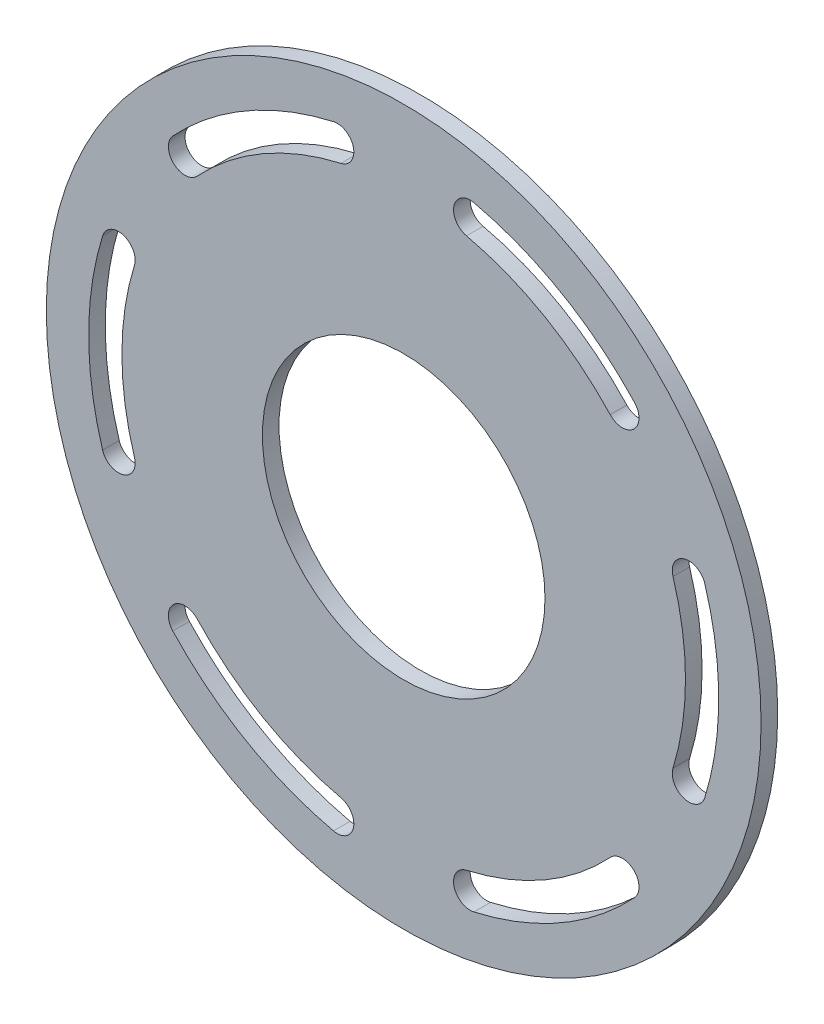
ISO-10303-21;
HEADER;
FILE_DESCRIPTION(('STEP AP214'),'2;1');
FILE_NAME('part.step','',(''),(''),'','','');
FILE_SCHEMA(('AUTOMOTIVE_DESIGN { 1 0 10303 214 1 1 1 1 }'));
ENDSEC;
DATA;
#1=APPLICATION_CONTEXT('core data for automotive mechanical design processes');
#2=APPLICATION_PROTOCOL_DEFINITION('international standard','automotive_design',2000,#1);
#3=PRODUCT_CONTEXT('',#1,'mechanical');
#4=PRODUCT('Part','Part','',(#3));
#5=PRODUCT_RELATED_PRODUCT_CATEGORY('part','',(#4));
#6=PRODUCT_DEFINITION_FORMATION('','',#4);
#7=PRODUCT_DEFINITION_CONTEXT('part definition',#1,'design');
#8=PRODUCT_DEFINITION('design','',#6,#7);
#9=PRODUCT_DEFINITION_SHAPE('','',#8);
#10=(LENGTH_UNIT() NAMED_UNIT(*) SI_UNIT(.MILLI.,.METRE.));
#11=(NAMED_UNIT(*) PLANE_ANGLE_UNIT() SI_UNIT($,.RADIAN.));
#12=(NAMED_UNIT(*) SI_UNIT($,.STERADIAN.) SOLID_ANGLE_UNIT());
#13=UNCERTAINTY_MEASURE_WITH_UNIT(LENGTH_MEASURE(1.E-05),#10,'distance_accuracy_value','');
#14=(GEOMETRIC_REPRESENTATION_CONTEXT(3) GLOBAL_UNCERTAINTY_ASSIGNED_CONTEXT((#13)) GLOBAL_UNIT_ASSIGNED_CONTEXT((#10,
#11,#12)) REPRESENTATION_CONTEXT('',''));
#15=CARTESIAN_POINT('',(0.,0.,0.));
#16=DIRECTION('',(0.,0.,1.));
#17=DIRECTION('',(1.,0.,0.));
#18=AXIS2_PLACEMENT_3D('',#15,#16,#17);
#19=CARTESIAN_POINT('',(-41.7704458034202,38.7808749661933,3.175));
#20=DIRECTION('',(0.,0.,-1.));
#21=DIRECTION('',(-1.,0.,0.));
#22=AXIS2_PLACEMENT_3D('',#19,#20,#21);
#23=CYLINDRICAL_SURFACE('',#22,3.17499999999988);
#24=CARTESIAN_POINT('',(-41.7704458034202,38.7808749661933,0.));
#25=DIRECTION('',(0.,0.,1.));
#26=DIRECTION('',(1.,0.,0.));
#27=AXIS2_PLACEMENT_3D('',#24,#25,#26);
#28=CIRCLE('',#27,3.17499999999988);
#29=CARTESIAN_POINT('',(-44.0972308860527,40.9411286964847,0.));
#30=VERTEX_POINT('',#29);
#31=CARTESIAN_POINT('',(-39.4436607207876,36.6206212359019,0.));
#32=VERTEX_POINT('',#31);
#33=EDGE_CURVE('E302',#30,#32,#28,.T.);
#34=ORIENTED_EDGE('',*,*,#33,.F.);
#35=DIRECTION('',(0.,0.,-1.));
#36=VECTOR('',#35,1.);
#37=CARTESIAN_POINT('',(-44.0972308860527,40.9411286964847,3.175));
#38=LINE('',#37,#36);
#39=CARTESIAN_POINT('',(-44.0972308860527,40.9411286964847,3.175));
#40=VERTEX_POINT('',#39);
#41=EDGE_CURVE('E11',#40,#30,#38,.T.);
#42=ORIENTED_EDGE('',*,*,#41,.F.);
#43=CARTESIAN_POINT('',(-41.7704458034202,38.7808749661933,3.175));
#44=DIRECTION('',(0.,0.,1.));
#45=DIRECTION('',(1.,0.,0.));
#46=AXIS2_PLACEMENT_3D('',#43,#44,#45);
#47=CIRCLE('',#46,3.17499999999988);
#48=CARTESIAN_POINT('',(-39.4436607207876,36.6206212359019,3.175));
#49=VERTEX_POINT('',#48);
#50=EDGE_CURVE('E228',#40,#49,#47,.T.);
#51=ORIENTED_EDGE('',*,*,#50,.T.);
#52=DIRECTION('',(0.,0.,-1.));
#53=VECTOR('',#52,1.);
#54=CARTESIAN_POINT('',(-39.4436607207876,36.6206212359019,3.175));
#55=LINE('',#54,#53);
#56=EDGE_CURVE('E144',#49,#32,#55,.T.);
#57=ORIENTED_EDGE('',*,*,#56,.T.);
#58=EDGE_LOOP('',(#34,#42,#51,#57));
#59=FACE_BOUND('',#58,.T.);
#60=ADVANCED_FACE('F43',(#59),#23,.F.);
#61=CARTESIAN_POINT('',(0.,0.,3.175));
#62=DIRECTION('',(0.,0.,-1.));
#63=DIRECTION('',(-1.,0.,0.));
#64=AXIS2_PLACEMENT_3D('',#61,#62,#63);
#65=CYLINDRICAL_SURFACE('',#64,60.1725999999997);
#66=CARTESIAN_POINT('',(0.,0.,0.));
#67=DIRECTION('',(0.,0.,1.));
#68=DIRECTION('',(1.,0.,0.));
#69=AXIS2_PLACEMENT_3D('',#66,#67,#68);
#70=CIRCLE('',#69,60.1725999999997);
#71=CARTESIAN_POINT('',(-13.4074420677361,58.659886532112,0.));
#72=VERTEX_POINT('',#71);
#73=EDGE_CURVE('E219',#72,#30,#70,.T.);
#74=ORIENTED_EDGE('',*,*,#73,.F.);
#75=DIRECTION('',(0.,0.,-1.));
#76=VECTOR('',#75,1.);
#77=CARTESIAN_POINT('',(-13.4074420677361,58.659886532112,3.175));
#78=LINE('',#77,#76);
#79=CARTESIAN_POINT('',(-13.4074420677361,58.659886532112,3.175));
#80=VERTEX_POINT('',#79);
#81=EDGE_CURVE('E53',#80,#72,#78,.T.);
#82=ORIENTED_EDGE('',*,*,#81,.F.);
#83=CARTESIAN_POINT('',(0.,0.,3.175));
#84=DIRECTION('',(0.,0.,1.));
#85=DIRECTION('',(1.,0.,0.));
#86=AXIS2_PLACEMENT_3D('',#83,#84,#85);
#87=CIRCLE('',#86,60.1725999999997);
#88=EDGE_CURVE('E217',#80,#40,#87,.T.);
#89=ORIENTED_EDGE('',*,*,#88,.T.);
#90=ORIENTED_EDGE('',*,*,#41,.T.);
#91=EDGE_LOOP('',(#74,#82,#89,#90));
#92=FACE_BOUND('',#91,.T.);
#93=ADVANCED_FACE('F216',(#92),#65,.F.);
#94=CARTESIAN_POINT('',(-12.7,55.5647046762601,3.175));
#95=DIRECTION('',(0.,0.,-1.));
#96=DIRECTION('',(-1.,0.,0.));
#97=AXIS2_PLACEMENT_3D('',#94,#95,#96);
#98=CYLINDRICAL_SURFACE('',#97,3.17499999999988);
#99=CARTESIAN_POINT('',(-12.7,55.5647046762601,0.));
#100=DIRECTION('',(0.,0.,1.));
#101=DIRECTION('',(1.,0.,0.));
#102=AXIS2_PLACEMENT_3D('',#99,#100,#101);
#103=CIRCLE('',#102,3.17499999999988);
#104=CARTESIAN_POINT('',(-11.9925579322638,52.4695228204077,0.));
#105=VERTEX_POINT('',#104);
#106=EDGE_CURVE('E306',#105,#72,#103,.T.);
#107=ORIENTED_EDGE('',*,*,#106,.F.);
#108=DIRECTION('',(0.,0.,-1.));
#109=VECTOR('',#108,1.);
#110=CARTESIAN_POINT('',(-11.9925579322638,52.4695228204077,3.175));
#111=LINE('',#110,#109);
#112=CARTESIAN_POINT('',(-11.9925579322638,52.4695228204077,3.175));
#113=VERTEX_POINT('',#112);
#114=EDGE_CURVE('E137',#113,#105,#111,.T.);
#115=ORIENTED_EDGE('',*,*,#114,.F.);
#116=CARTESIAN_POINT('',(-12.7,55.5647046762601,3.175));
#117=DIRECTION('',(0.,0.,1.));
#118=DIRECTION('',(1.,0.,0.));
#119=AXIS2_PLACEMENT_3D('',#116,#117,#118);
#120=CIRCLE('',#119,3.17499999999988);
#121=EDGE_CURVE('E227',#113,#80,#120,.T.);
#122=ORIENTED_EDGE('',*,*,#121,.T.);
#123=ORIENTED_EDGE('',*,*,#81,.T.);
#124=EDGE_LOOP('',(#107,#115,#122,#123));
#125=FACE_BOUND('',#124,.T.);
#126=ADVANCED_FACE('F230',(#125),#98,.F.);
#127=CARTESIAN_POINT('',(0.,0.,3.175));
#128=DIRECTION('',(0.,0.,-1.));
#129=DIRECTION('',(-1.,0.,0.));
#130=AXIS2_PLACEMENT_3D('',#127,#128,#129);
#131=CYLINDRICAL_SURFACE('',#130,60.1725999999997);
#132=CARTESIAN_POINT('',(0.,0.,0.));
#133=DIRECTION('',(0.,0.,1.));
#134=DIRECTION('',(1.,0.,0.));
#135=AXIS2_PLACEMENT_3D('',#132,#133,#134);
#136=CIRCLE('',#135,60.1725999999997);
#137=CARTESIAN_POINT('',(44.0972308860538,40.9411286964838,0.));
#138=VERTEX_POINT('',#137);
#139=CARTESIAN_POINT('',(13.4074420677375,58.6598865321118,0.));
#140=VERTEX_POINT('',#139);
#141=EDGE_CURVE('E290',#138,#140,#136,.T.);
#142=ORIENTED_EDGE('',*,*,#141,.F.);
#143=DIRECTION('',(0.,0.,-1.));
#144=VECTOR('',#143,1.);
#145=CARTESIAN_POINT('',(44.0972308860538,40.9411286964838,3.175));
#146=LINE('',#145,#144);
#147=CARTESIAN_POINT('',(44.0972308860538,40.9411286964838,3.175));
#148=VERTEX_POINT('',#147);
#149=EDGE_CURVE('E315',#148,#138,#146,.T.);
#150=ORIENTED_EDGE('',*,*,#149,.F.);
#151=CARTESIAN_POINT('',(0.,0.,3.175));
#152=DIRECTION('',(0.,0.,1.));
#153=DIRECTION('',(1.,0.,0.));
#154=AXIS2_PLACEMENT_3D('',#151,#152,#153);
#155=CIRCLE('',#154,60.1725999999997);
#156=CARTESIAN_POINT('',(13.4074420677375,58.6598865321118,3.175));
#157=VERTEX_POINT('',#156);
#158=EDGE_CURVE('E411',#148,#157,#155,.T.);
#159=ORIENTED_EDGE('',*,*,#158,.T.);
#160=DIRECTION('',(0.,0.,-1.));
#161=VECTOR('',#160,1.);
#162=CARTESIAN_POINT('',(13.4074420677375,58.6598865321118,3.175));
#163=LINE('',#162,#161);
#164=EDGE_CURVE('E317',#157,#140,#163,.T.);
#165=ORIENTED_EDGE('',*,*,#164,.T.);
#166=EDGE_LOOP('',(#142,#150,#159,#165));
#167=FACE_BOUND('',#166,.T.);
#168=ADVANCED_FACE('F452',(#167),#131,.F.);
#169=CARTESIAN_POINT('',(41.7704458034212,38.7808749661924,3.175));
#170=DIRECTION('',(0.,0.,-1.));
#171=DIRECTION('',(-1.,0.,0.));
#172=AXIS2_PLACEMENT_3D('',#169,#170,#171);
#173=CYLINDRICAL_SURFACE('',#172,3.17499999999988);
#174=CARTESIAN_POINT('',(41.7704458034212,38.7808749661924,0.));
#175=DIRECTION('',(0.,0.,1.));
#176=DIRECTION('',(1.,0.,0.));
#177=AXIS2_PLACEMENT_3D('',#174,#175,#176);
#178=CIRCLE('',#177,3.17499999999988);
#179=CARTESIAN_POINT('',(39.4436607207885,36.6206212359009,0.));
#180=VERTEX_POINT('',#179);
#181=EDGE_CURVE('E293',#180,#138,#178,.T.);
#182=ORIENTED_EDGE('',*,*,#181,.F.);
#183=DIRECTION('',(0.,0.,-1.));
#184=VECTOR('',#183,1.);
#185=CARTESIAN_POINT('',(39.4436607207885,36.6206212359009,3.175));
#186=LINE('',#185,#184);
#187=CARTESIAN_POINT('',(39.4436607207885,36.6206212359009,3.175));
#188=VERTEX_POINT('',#187);
#189=EDGE_CURVE('E322',#188,#180,#186,.T.);
#190=ORIENTED_EDGE('',*,*,#189,.F.);
#191=CARTESIAN_POINT('',(41.7704458034212,38.7808749661924,3.175));
#192=DIRECTION('',(0.,0.,1.));
#193=DIRECTION('',(1.,0.,0.));
#194=AXIS2_PLACEMENT_3D('',#191,#192,#193);
#195=CIRCLE('',#194,3.17499999999988);
#196=EDGE_CURVE('E414',#188,#148,#195,.T.);
#197=ORIENTED_EDGE('',*,*,#196,.T.);
#198=ORIENTED_EDGE('',*,*,#149,.T.);
#199=EDGE_LOOP('',(#182,#190,#197,#198));
#200=FACE_BOUND('',#199,.T.);
#201=ADVANCED_FACE('F448',(#200),#173,.F.);
#202=CARTESIAN_POINT('',(0.,0.,3.175));
#203=DIRECTION('',(0.,0.,-1.));
#204=DIRECTION('',(-1.,0.,0.));
#205=AXIS2_PLACEMENT_3D('',#202,#203,#204);
#206=CYLINDRICAL_SURFACE('',#205,53.8225999999999);
#207=CARTESIAN_POINT('',(0.,0.,0.));
#208=DIRECTION('',(0.,0.,1.));
#209=DIRECTION('',(1.,0.,0.));
#210=AXIS2_PLACEMENT_3D('',#207,#208,#209);
#211=CIRCLE('',#210,53.8225999999999);
#212=CARTESIAN_POINT('',(11.9925579322651,52.4695228204074,0.));
#213=VERTEX_POINT('',#212);
#214=EDGE_CURVE('E296',#180,#213,#211,.T.);
#215=ORIENTED_EDGE('',*,*,#214,.T.);
#216=DIRECTION('',(0.,0.,-1.));
#217=VECTOR('',#216,1.);
#218=CARTESIAN_POINT('',(11.9925579322651,52.4695228204074,3.175));
#219=LINE('',#218,#217);
#220=CARTESIAN_POINT('',(11.9925579322651,52.4695228204074,3.175));
#221=VERTEX_POINT('',#220);
#222=EDGE_CURVE('E319',#221,#213,#219,.T.);
#223=ORIENTED_EDGE('',*,*,#222,.F.);
#224=CARTESIAN_POINT('',(0.,0.,3.175));
#225=DIRECTION('',(0.,0.,1.));
#226=DIRECTION('',(1.,0.,0.));
#227=AXIS2_PLACEMENT_3D('',#224,#225,#226);
#228=CIRCLE('',#227,53.8225999999999);
#229=EDGE_CURVE('E417',#188,#221,#228,.T.);
#230=ORIENTED_EDGE('',*,*,#229,.F.);
#231=ORIENTED_EDGE('',*,*,#189,.T.);
#232=EDGE_LOOP('',(#215,#223,#230,#231));
#233=FACE_BOUND('',#232,.T.);
#234=ADVANCED_FACE('F444',(#233),#206,.T.);
#235=CARTESIAN_POINT('',(0.,0.,3.175));
#236=DIRECTION('',(0.,0.,-1.));
#237=DIRECTION('',(-1.,0.,0.));
#238=AXIS2_PLACEMENT_3D('',#235,#236,#237);
#239=CYLINDRICAL_SURFACE('',#238,60.1725999999997);
#240=CARTESIAN_POINT('',(0.,0.,0.));
#241=DIRECTION('',(0.,0.,1.));
#242=DIRECTION('',(1.,0.,0.));
#243=AXIS2_PLACEMENT_3D('',#240,#241,#242);
#244=CIRCLE('',#243,60.1725999999997);
#245=CARTESIAN_POINT('',(57.50467295379,-17.7187578356284,0.));
#246=VERTEX_POINT('',#245);
#247=CARTESIAN_POINT('',(57.5046729537902,17.7187578356271,0.));
#248=VERTEX_POINT('',#247);
#249=EDGE_CURVE('E278',#246,#248,#244,.T.);
#250=ORIENTED_EDGE('',*,*,#249,.F.);
#251=DIRECTION('',(0.,0.,-1.));
#252=VECTOR('',#251,1.);
#253=CARTESIAN_POINT('',(57.50467295379,-17.7187578356284,3.175));
#254=LINE('',#253,#252);
#255=CARTESIAN_POINT('',(57.50467295379,-17.7187578356284,3.175));
#256=VERTEX_POINT('',#255);
#257=EDGE_CURVE('E320',#256,#246,#254,.T.);
#258=ORIENTED_EDGE('',*,*,#257,.F.);
#259=CARTESIAN_POINT('',(0.,0.,3.175));
#260=DIRECTION('',(0.,0.,1.));
#261=DIRECTION('',(1.,0.,0.));
#262=AXIS2_PLACEMENT_3D('',#259,#260,#261);
#263=CIRCLE('',#262,60.1725999999997);
#264=CARTESIAN_POINT('',(57.5046729537902,17.7187578356271,3.175));
#265=VERTEX_POINT('',#264);
#266=EDGE_CURVE('E400',#256,#265,#263,.T.);
#267=ORIENTED_EDGE('',*,*,#266,.T.);
#268=DIRECTION('',(0.,0.,-1.));
#269=VECTOR('',#268,1.);
#270=CARTESIAN_POINT('',(57.5046729537902,17.7187578356271,3.175));
#271=LINE('',#270,#269);
#272=EDGE_CURVE('E325',#265,#248,#271,.T.);
#273=ORIENTED_EDGE('',*,*,#272,.T.);
#274=EDGE_LOOP('',(#250,#258,#267,#273));
#275=FACE_BOUND('',#274,.T.);
#276=ADVANCED_FACE('F447',(#275),#239,.F.);
#277=CARTESIAN_POINT('',(54.4704458034212,-16.7838297100677,3.175));
#278=DIRECTION('',(0.,0.,-1.));
#279=DIRECTION('',(-1.,0.,0.));
#280=AXIS2_PLACEMENT_3D('',#277,#278,#279);
#281=CYLINDRICAL_SURFACE('',#280,3.17499999999988);
#282=CARTESIAN_POINT('',(54.4704458034212,-16.7838297100677,0.));
#283=DIRECTION('',(0.,0.,1.));
#284=DIRECTION('',(1.,0.,0.));
#285=AXIS2_PLACEMENT_3D('',#282,#283,#284);
#286=CIRCLE('',#285,3.17499999999988);
#287=CARTESIAN_POINT('',(51.4362186530523,-15.8489015845068,0.));
#288=VERTEX_POINT('',#287);
#289=EDGE_CURVE('E281',#288,#246,#286,.T.);
#290=ORIENTED_EDGE('',*,*,#289,.F.);
#291=DIRECTION('',(0.,0.,-1.));
#292=VECTOR('',#291,1.);
#293=CARTESIAN_POINT('',(51.4362186530523,-15.8489015845068,3.175));
#294=LINE('',#293,#292);
#295=CARTESIAN_POINT('',(51.4362186530523,-15.8489015845068,3.175));
#296=VERTEX_POINT('',#295);
#297=EDGE_CURVE('E330',#296,#288,#294,.T.);
#298=ORIENTED_EDGE('',*,*,#297,.F.);
#299=CARTESIAN_POINT('',(54.4704458034212,-16.7838297100677,3.175));
#300=DIRECTION('',(0.,0.,1.));
#301=DIRECTION('',(1.,0.,0.));
#302=AXIS2_PLACEMENT_3D('',#299,#300,#301);
#303=CIRCLE('',#302,3.17499999999988);
#304=EDGE_CURVE('E403',#296,#256,#303,.T.);
#305=ORIENTED_EDGE('',*,*,#304,.T.);
#306=ORIENTED_EDGE('',*,*,#257,.T.);
#307=EDGE_LOOP('',(#290,#298,#305,#306));
#308=FACE_BOUND('',#307,.T.);
#309=ADVANCED_FACE('F465',(#308),#281,.F.);
#310=CARTESIAN_POINT('',(0.,0.,3.175));
#311=DIRECTION('',(0.,0.,-1.));
#312=DIRECTION('',(-1.,0.,0.));
#313=AXIS2_PLACEMENT_3D('',#310,#311,#312);
#314=CYLINDRICAL_SURFACE('',#313,53.8225999999999);
#315=CARTESIAN_POINT('',(0.,0.,0.));
#316=DIRECTION('',(0.,0.,1.));
#317=DIRECTION('',(1.,0.,0.));
#318=AXIS2_PLACEMENT_3D('',#315,#316,#317);
#319=CIRCLE('',#318,53.8225999999999);
#320=CARTESIAN_POINT('',(51.4362186530527,15.8489015845056,0.));
#321=VERTEX_POINT('',#320);
#322=EDGE_CURVE('E284',#288,#321,#319,.T.);
#323=ORIENTED_EDGE('',*,*,#322,.T.);
#324=DIRECTION('',(0.,0.,-1.));
#325=VECTOR('',#324,1.);
#326=CARTESIAN_POINT('',(51.4362186530527,15.8489015845056,3.175));
#327=LINE('',#326,#325);
#328=CARTESIAN_POINT('',(51.4362186530527,15.8489015845056,3.175));
#329=VERTEX_POINT('',#328);
#330=EDGE_CURVE('E327',#329,#321,#327,.T.);
#331=ORIENTED_EDGE('',*,*,#330,.F.);
#332=CARTESIAN_POINT('',(0.,0.,3.175));
#333=DIRECTION('',(0.,0.,1.));
#334=DIRECTION('',(1.,0.,0.));
#335=AXIS2_PLACEMENT_3D('',#332,#333,#334);
#336=CIRCLE('',#335,53.8225999999999);
#337=EDGE_CURVE('E406',#296,#329,#336,.T.);
#338=ORIENTED_EDGE('',*,*,#337,.F.);
#339=ORIENTED_EDGE('',*,*,#297,.T.);
#340=EDGE_LOOP('',(#323,#331,#338,#339));
#341=FACE_BOUND('',#340,.T.);
#342=ADVANCED_FACE('F461',(#341),#314,.T.);
#343=CARTESIAN_POINT('',(0.,0.,3.175));
#344=DIRECTION('',(0.,0.,-1.));
#345=DIRECTION('',(-1.,0.,0.));
#346=AXIS2_PLACEMENT_3D('',#343,#344,#345);
#347=CYLINDRICAL_SURFACE('',#346,60.1725999999997);
#348=CARTESIAN_POINT('',(0.,0.,0.));
#349=DIRECTION('',(0.,0.,1.));
#350=DIRECTION('',(1.,0.,0.));
#351=AXIS2_PLACEMENT_3D('',#348,#349,#350);
#352=CIRCLE('',#351,60.1725999999997);
#353=CARTESIAN_POINT('',(13.4074420677362,-58.6598865321123,0.));
#354=VERTEX_POINT('',#353);
#355=CARTESIAN_POINT('',(44.0972308860527,-40.9411286964847,0.));
#356=VERTEX_POINT('',#355);
#357=EDGE_CURVE('E266',#354,#356,#352,.T.);
#358=ORIENTED_EDGE('',*,*,#357,.F.);
#359=DIRECTION('',(0.,0.,-1.));
#360=VECTOR('',#359,1.);
#361=CARTESIAN_POINT('',(13.4074420677362,-58.6598865321123,3.175));
#362=LINE('',#361,#360);
#363=CARTESIAN_POINT('',(13.4074420677362,-58.6598865321123,3.175));
#364=VERTEX_POINT('',#363);
#365=EDGE_CURVE('E328',#364,#354,#362,.T.);
#366=ORIENTED_EDGE('',*,*,#365,.F.);
#367=CARTESIAN_POINT('',(0.,0.,3.175));
#368=DIRECTION('',(0.,0.,1.));
#369=DIRECTION('',(1.,0.,0.));
#370=AXIS2_PLACEMENT_3D('',#367,#368,#369);
#371=CIRCLE('',#370,60.1725999999997);
#372=CARTESIAN_POINT('',(44.0972308860527,-40.9411286964847,3.175));
#373=VERTEX_POINT('',#372);
#374=EDGE_CURVE('E389',#364,#373,#371,.T.);
#375=ORIENTED_EDGE('',*,*,#374,.T.);
#376=DIRECTION('',(0.,0.,-1.));
#377=VECTOR('',#376,1.);
#378=CARTESIAN_POINT('',(44.0972308860527,-40.9411286964847,3.175));
#379=LINE('',#378,#377);
#380=EDGE_CURVE('E333',#373,#356,#379,.T.);
#381=ORIENTED_EDGE('',*,*,#380,.T.);
#382=EDGE_LOOP('',(#358,#366,#375,#381));
#383=FACE_BOUND('',#382,.T.);
#384=ADVANCED_FACE('F464',(#383),#347,.F.);
#385=CARTESIAN_POINT('',(12.7,-55.5647046762601,3.175));
#386=DIRECTION('',(0.,0.,-1.));
#387=DIRECTION('',(-1.,0.,0.));
#388=AXIS2_PLACEMENT_3D('',#385,#386,#387);
#389=CYLINDRICAL_SURFACE('',#388,3.17499999999988);
#390=CARTESIAN_POINT('',(12.7,-55.5647046762601,0.));
#391=DIRECTION('',(0.,0.,1.));
#392=DIRECTION('',(1.,0.,0.));
#393=AXIS2_PLACEMENT_3D('',#390,#391,#392);
#394=CIRCLE('',#393,3.17499999999988);
#395=CARTESIAN_POINT('',(11.9925579322638,-52.4695228204077,0.));
#396=VERTEX_POINT('',#395);
#397=EDGE_CURVE('E269',#396,#354,#394,.T.);
#398=ORIENTED_EDGE('',*,*,#397,.F.);
#399=DIRECTION('',(0.,0.,-1.));
#400=VECTOR('',#399,1.);
#401=CARTESIAN_POINT('',(11.9925579322638,-52.4695228204077,3.175));
#402=LINE('',#401,#400);
#403=CARTESIAN_POINT('',(11.9925579322638,-52.4695228204077,3.175));
#404=VERTEX_POINT('',#403);
#405=EDGE_CURVE('E338',#404,#396,#402,.T.);
#406=ORIENTED_EDGE('',*,*,#405,.F.);
#407=CARTESIAN_POINT('',(12.7,-55.5647046762601,3.175));
#408=DIRECTION('',(0.,0.,1.));
#409=DIRECTION('',(1.,0.,0.));
#410=AXIS2_PLACEMENT_3D('',#407,#408,#409);
#411=CIRCLE('',#410,3.17499999999988);
#412=EDGE_CURVE('E392',#404,#364,#411,.T.);
#413=ORIENTED_EDGE('',*,*,#412,.T.);
#414=ORIENTED_EDGE('',*,*,#365,.T.);
#415=EDGE_LOOP('',(#398,#406,#413,#414));
#416=FACE_BOUND('',#415,.T.);
#417=ADVANCED_FACE('F481',(#416),#389,.F.);
#418=CARTESIAN_POINT('',(0.,0.,3.175));
#419=DIRECTION('',(0.,0.,-1.));
#420=DIRECTION('',(-1.,0.,0.));
#421=AXIS2_PLACEMENT_3D('',#418,#419,#420);
#422=CYLINDRICAL_SURFACE('',#421,53.8225999999999);
#423=CARTESIAN_POINT('',(0.,0.,0.));
#424=DIRECTION('',(0.,0.,1.));
#425=DIRECTION('',(1.,0.,0.));
#426=AXIS2_PLACEMENT_3D('',#423,#424,#425);
#427=CIRCLE('',#426,53.8225999999999);
#428=CARTESIAN_POINT('',(39.4436607207876,-36.6206212359019,0.));
#429=VERTEX_POINT('',#428);
#430=EDGE_CURVE('E272',#396,#429,#427,.T.);
#431=ORIENTED_EDGE('',*,*,#430,.T.);
#432=DIRECTION('',(0.,0.,-1.));
#433=VECTOR('',#432,1.);
#434=CARTESIAN_POINT('',(39.4436607207876,-36.6206212359019,3.175));
#435=LINE('',#434,#433);
#436=CARTESIAN_POINT('',(39.4436607207876,-36.6206212359019,3.175));
#437=VERTEX_POINT('',#436);
#438=EDGE_CURVE('E335',#437,#429,#435,.T.);
#439=ORIENTED_EDGE('',*,*,#438,.F.);
#440=CARTESIAN_POINT('',(0.,0.,3.175));
#441=DIRECTION('',(0.,0.,1.));
#442=DIRECTION('',(1.,0.,0.));
#443=AXIS2_PLACEMENT_3D('',#440,#441,#442);
#444=CIRCLE('',#443,53.8225999999999);
#445=EDGE_CURVE('E395',#404,#437,#444,.T.);
#446=ORIENTED_EDGE('',*,*,#445,.F.);
#447=ORIENTED_EDGE('',*,*,#405,.T.);
#448=EDGE_LOOP('',(#431,#439,#446,#447));
#449=FACE_BOUND('',#448,.T.);
#450=ADVANCED_FACE('F477',(#449),#422,.T.);
#451=CARTESIAN_POINT('',(0.,0.,3.175));
#452=DIRECTION('',(0.,0.,-1.));
#453=DIRECTION('',(-1.,0.,0.));
#454=AXIS2_PLACEMENT_3D('',#451,#452,#453);
#455=CYLINDRICAL_SURFACE('',#454,60.1725999999997);
#456=CARTESIAN_POINT('',(0.,0.,0.));
#457=DIRECTION('',(0.,0.,1.));
#458=DIRECTION('',(1.,0.,0.));
#459=AXIS2_PLACEMENT_3D('',#456,#457,#458);
#460=CIRCLE('',#459,60.1725999999997);
#461=CARTESIAN_POINT('',(-44.0972308860538,-40.9411286964838,0.));
#462=VERTEX_POINT('',#461);
#463=CARTESIAN_POINT('',(-13.4074420677374,-58.6598865321118,0.));
#464=VERTEX_POINT('',#463);
#465=EDGE_CURVE('E254',#462,#464,#460,.T.);
#466=ORIENTED_EDGE('',*,*,#465,.F.);
#467=DIRECTION('',(0.,0.,-1.));
#468=VECTOR('',#467,1.);
#469=CARTESIAN_POINT('',(-44.0972308860538,-40.9411286964838,3.175));
#470=LINE('',#469,#468);
#471=CARTESIAN_POINT('',(-44.0972308860538,-40.9411286964838,3.175));
#472=VERTEX_POINT('',#471);
#473=EDGE_CURVE('E336',#472,#462,#470,.T.);
#474=ORIENTED_EDGE('',*,*,#473,.F.);
#475=CARTESIAN_POINT('',(0.,0.,3.175));
#476=DIRECTION('',(0.,0.,1.));
#477=DIRECTION('',(1.,0.,0.));
#478=AXIS2_PLACEMENT_3D('',#475,#476,#477);
#479=CIRCLE('',#478,60.1725999999997);
#480=CARTESIAN_POINT('',(-13.4074420677374,-58.6598865321118,3.175));
#481=VERTEX_POINT('',#480);
#482=EDGE_CURVE('E374',#472,#481,#479,.T.);
#483=ORIENTED_EDGE('',*,*,#482,.T.);
#484=DIRECTION('',(0.,0.,-1.));
#485=VECTOR('',#484,1.);
#486=CARTESIAN_POINT('',(-13.4074420677374,-58.6598865321118,3.175));
#487=LINE('',#486,#485);
#488=EDGE_CURVE('E341',#481,#464,#487,.T.);
#489=ORIENTED_EDGE('',*,*,#488,.T.);
#490=EDGE_LOOP('',(#466,#474,#483,#489));
#491=FACE_BOUND('',#490,.T.);
#492=ADVANCED_FACE('F480',(#491),#455,.F.);
#493=CARTESIAN_POINT('',(-41.7704458034212,-38.7808749661924,3.175));
#494=DIRECTION('',(0.,0.,-1.));
#495=DIRECTION('',(-1.,0.,0.));
#496=AXIS2_PLACEMENT_3D('',#493,#494,#495);
#497=CYLINDRICAL_SURFACE('',#496,3.17499999999988);
#498=CARTESIAN_POINT('',(-41.7704458034212,-38.7808749661924,0.));
#499=DIRECTION('',(0.,0.,1.));
#500=DIRECTION('',(1.,0.,0.));
#501=AXIS2_PLACEMENT_3D('',#498,#499,#500);
#502=CIRCLE('',#501,3.17499999999988);
#503=CARTESIAN_POINT('',(-39.4436607207885,-36.6206212359009,0.));
#504=VERTEX_POINT('',#503);
#505=EDGE_CURVE('E257',#504,#462,#502,.T.);
#506=ORIENTED_EDGE('',*,*,#505,.F.);
#507=DIRECTION('',(0.,0.,-1.));
#508=VECTOR('',#507,1.);
#509=CARTESIAN_POINT('',(-39.4436607207885,-36.6206212359009,3.175));
#510=LINE('',#509,#508);
#511=CARTESIAN_POINT('',(-39.4436607207885,-36.6206212359009,3.175));
#512=VERTEX_POINT('',#511);
#513=EDGE_CURVE('E345',#512,#504,#510,.T.);
#514=ORIENTED_EDGE('',*,*,#513,.F.);
#515=CARTESIAN_POINT('',(-41.7704458034212,-38.7808749661924,3.175));
#516=DIRECTION('',(0.,0.,1.));
#517=DIRECTION('',(1.,0.,0.));
#518=AXIS2_PLACEMENT_3D('',#515,#516,#517);
#519=CIRCLE('',#518,3.17499999999988);
#520=EDGE_CURVE('E377',#512,#472,#519,.T.);
#521=ORIENTED_EDGE('',*,*,#520,.T.);
#522=ORIENTED_EDGE('',*,*,#473,.T.);
#523=EDGE_LOOP('',(#506,#514,#521,#522));
#524=FACE_BOUND('',#523,.T.);
#525=ADVANCED_FACE('F495',(#524),#497,.F.);
#526=CARTESIAN_POINT('',(0.,0.,3.175));
#527=DIRECTION('',(0.,0.,-1.));
#528=DIRECTION('',(-1.,0.,0.));
#529=AXIS2_PLACEMENT_3D('',#526,#527,#528);
#530=CYLINDRICAL_SURFACE('',#529,53.8225999999999);
#531=CARTESIAN_POINT('',(0.,0.,0.));
#532=DIRECTION('',(0.,0.,1.));
#533=DIRECTION('',(1.,0.,0.));
#534=AXIS2_PLACEMENT_3D('',#531,#532,#533);
#535=CIRCLE('',#534,53.8225999999999);
#536=CARTESIAN_POINT('',(-11.9925579322651,-52.4695228204074,0.));
#537=VERTEX_POINT('',#536);
#538=EDGE_CURVE('E260',#504,#537,#535,.T.);
#539=ORIENTED_EDGE('',*,*,#538,.T.);
#540=DIRECTION('',(0.,0.,-1.));
#541=VECTOR('',#540,1.);
#542=CARTESIAN_POINT('',(-11.9925579322651,-52.4695228204074,3.175));
#543=LINE('',#542,#541);
#544=CARTESIAN_POINT('',(-11.9925579322651,-52.4695228204074,3.175));
#545=VERTEX_POINT('',#544);
#546=EDGE_CURVE('E343',#545,#537,#543,.T.);
#547=ORIENTED_EDGE('',*,*,#546,.F.);
#548=CARTESIAN_POINT('',(0.,0.,3.175));
#549=DIRECTION('',(0.,0.,1.));
#550=DIRECTION('',(1.,0.,0.));
#551=AXIS2_PLACEMENT_3D('',#548,#549,#550);
#552=CIRCLE('',#551,53.8225999999999);
#553=EDGE_CURVE('E384',#512,#545,#552,.T.);
#554=ORIENTED_EDGE('',*,*,#553,.F.);
#555=ORIENTED_EDGE('',*,*,#513,.T.);
#556=EDGE_LOOP('',(#539,#547,#554,#555));
#557=FACE_BOUND('',#556,.T.);
#558=ADVANCED_FACE('F492',(#557),#530,.T.);
#559=CARTESIAN_POINT('',(0.,0.,3.175));
#560=DIRECTION('',(0.,0.,-1.));
#561=DIRECTION('',(-1.,0.,0.));
#562=AXIS2_PLACEMENT_3D('',#559,#560,#561);
#563=CYLINDRICAL_SURFACE('',#562,60.1725999999997);
#564=CARTESIAN_POINT('',(0.,0.,0.));
#565=DIRECTION('',(0.,0.,1.));
#566=DIRECTION('',(1.,0.,0.));
#567=AXIS2_PLACEMENT_3D('',#564,#565,#566);
#568=CIRCLE('',#567,60.1725999999997);
#569=CARTESIAN_POINT('',(-57.50467295379,17.7187578356284,0.));
#570=VERTEX_POINT('',#569);
#571=CARTESIAN_POINT('',(-57.5046729537902,-17.7187578356271,0.));
#572=VERTEX_POINT('',#571);
#573=EDGE_CURVE('E242',#570,#572,#568,.T.);
#574=ORIENTED_EDGE('',*,*,#573,.F.);
#575=DIRECTION('',(0.,0.,-1.));
#576=VECTOR('',#575,1.);
#577=CARTESIAN_POINT('',(-57.50467295379,17.7187578356284,3.175));
#578=LINE('',#577,#576);
#579=CARTESIAN_POINT('',(-57.50467295379,17.7187578356284,3.175));
#580=VERTEX_POINT('',#579);
#581=EDGE_CURVE('E47',#580,#570,#578,.T.);
#582=ORIENTED_EDGE('',*,*,#581,.F.);
#583=CARTESIAN_POINT('',(0.,0.,3.175));
#584=DIRECTION('',(0.,0.,1.));
#585=DIRECTION('',(1.,0.,0.));
#586=AXIS2_PLACEMENT_3D('',#583,#584,#585);
#587=CIRCLE('',#586,60.1725999999997);
#588=CARTESIAN_POINT('',(-57.5046729537902,-17.7187578356271,3.175));
#589=VERTEX_POINT('',#588);
#590=EDGE_CURVE('E756',#580,#589,#587,.T.);
#591=ORIENTED_EDGE('',*,*,#590,.T.);
#592=DIRECTION('',(0.,0.,-1.));
#593=VECTOR('',#592,1.);
#594=CARTESIAN_POINT('',(-57.5046729537902,-17.7187578356271,3.175));
#595=LINE('',#594,#593);
#596=EDGE_CURVE('E238',#589,#572,#595,.T.);
#597=ORIENTED_EDGE('',*,*,#596,.T.);
#598=EDGE_LOOP('',(#574,#582,#591,#597));
#599=FACE_BOUND('',#598,.T.);
#600=ADVANCED_FACE('F360',(#599),#563,.F.);
#601=CARTESIAN_POINT('',(-54.4704458034213,16.7838297100676,3.175));
#602=DIRECTION('',(0.,0.,-1.));
#603=DIRECTION('',(-1.,0.,0.));
#604=AXIS2_PLACEMENT_3D('',#601,#602,#603);
#605=CYLINDRICAL_SURFACE('',#604,3.17499999999988);
#606=CARTESIAN_POINT('',(-54.4704458034213,16.7838297100676,0.));
#607=DIRECTION('',(0.,0.,1.));
#608=DIRECTION('',(1.,0.,0.));
#609=AXIS2_PLACEMENT_3D('',#606,#607,#608);
#610=CIRCLE('',#609,3.17499999999988);
#611=CARTESIAN_POINT('',(-51.4362186530523,15.8489015845068,0.));
#612=VERTEX_POINT('',#611);
#613=EDGE_CURVE('E245',#612,#570,#610,.T.);
#614=ORIENTED_EDGE('',*,*,#613,.F.);
#615=DIRECTION('',(0.,0.,-1.));
#616=VECTOR('',#615,1.);
#617=CARTESIAN_POINT('',(-51.4362186530523,15.8489015845068,3.175));
#618=LINE('',#617,#616);
#619=CARTESIAN_POINT('',(-51.4362186530523,15.8489015845068,3.175));
#620=VERTEX_POINT('',#619);
#621=EDGE_CURVE('E350',#620,#612,#618,.T.);
#622=ORIENTED_EDGE('',*,*,#621,.F.);
#623=CARTESIAN_POINT('',(-54.4704458034213,16.7838297100676,3.175));
#624=DIRECTION('',(0.,0.,1.));
#625=DIRECTION('',(1.,0.,0.));
#626=AXIS2_PLACEMENT_3D('',#623,#624,#625);
#627=CIRCLE('',#626,3.17499999999988);
#628=EDGE_CURVE('E359',#620,#580,#627,.T.);
#629=ORIENTED_EDGE('',*,*,#628,.T.);
#630=ORIENTED_EDGE('',*,*,#581,.T.);
#631=EDGE_LOOP('',(#614,#622,#629,#630));
#632=FACE_BOUND('',#631,.T.);
#633=ADVANCED_FACE('F357',(#632),#605,.F.);
#634=CARTESIAN_POINT('',(0.,0.,3.175));
#635=DIRECTION('',(0.,0.,-1.));
#636=DIRECTION('',(-1.,0.,0.));
#637=AXIS2_PLACEMENT_3D('',#634,#635,#636);
#638=CYLINDRICAL_SURFACE('',#637,53.8225999999999);
#639=CARTESIAN_POINT('',(0.,0.,0.));
#640=DIRECTION('',(0.,0.,1.));
#641=DIRECTION('',(1.,0.,0.));
#642=AXIS2_PLACEMENT_3D('',#639,#640,#641);
#643=CIRCLE('',#642,53.8225999999999);
#644=CARTESIAN_POINT('',(-51.4362186530527,-15.8489015845056,0.));
#645=VERTEX_POINT('',#644);
#646=EDGE_CURVE('E248',#612,#645,#643,.T.);
#647=ORIENTED_EDGE('',*,*,#646,.T.);
#648=DIRECTION('',(0.,0.,-1.));
#649=VECTOR('',#648,1.);
#650=CARTESIAN_POINT('',(-51.4362186530527,-15.8489015845056,3.175));
#651=LINE('',#650,#649);
#652=CARTESIAN_POINT('',(-51.4362186530527,-15.8489015845056,3.175));
#653=VERTEX_POINT('',#652);
#654=EDGE_CURVE('E349',#653,#645,#651,.T.);
#655=ORIENTED_EDGE('',*,*,#654,.F.);
#656=CARTESIAN_POINT('',(0.,0.,3.175));
#657=DIRECTION('',(0.,0.,1.));
#658=DIRECTION('',(1.,0.,0.));
#659=AXIS2_PLACEMENT_3D('',#656,#657,#658);
#660=CIRCLE('',#659,53.8225999999999);
#661=EDGE_CURVE('E368',#620,#653,#660,.T.);
#662=ORIENTED_EDGE('',*,*,#661,.F.);
#663=ORIENTED_EDGE('',*,*,#621,.T.);
#664=EDGE_LOOP('',(#647,#655,#662,#663));
#665=FACE_BOUND('',#664,.T.);
#666=ADVANCED_FACE('F366',(#665),#638,.T.);
#667=CARTESIAN_POINT('',(0.,0.,3.175));
#668=DIRECTION('',(0.,0.,-1.));
#669=DIRECTION('',(-1.,0.,0.));
#670=AXIS2_PLACEMENT_3D('',#667,#668,#669);
#671=CYLINDRICAL_SURFACE('',#670,53.8225999999999);
#672=CARTESIAN_POINT('',(0.,0.,0.));
#673=DIRECTION('',(0.,0.,1.));
#674=DIRECTION('',(1.,0.,0.));
#675=AXIS2_PLACEMENT_3D('',#672,#673,#674);
#676=CIRCLE('',#675,53.8225999999999);
#677=EDGE_CURVE('E308',#105,#32,#676,.T.);
#678=ORIENTED_EDGE('',*,*,#677,.T.);
#679=ORIENTED_EDGE('',*,*,#56,.F.);
#680=CARTESIAN_POINT('',(0.,0.,3.175));
#681=DIRECTION('',(0.,0.,1.));
#682=DIRECTION('',(1.,0.,0.));
#683=AXIS2_PLACEMENT_3D('',#680,#681,#682);
#684=CIRCLE('',#683,53.8225999999999);
#685=EDGE_CURVE('E62',#113,#49,#684,.T.);
#686=ORIENTED_EDGE('',*,*,#685,.F.);
#687=ORIENTED_EDGE('',*,*,#114,.T.);
#688=EDGE_LOOP('',(#678,#679,#686,#687));
#689=FACE_BOUND('',#688,.T.);
#690=ADVANCED_FACE('F423',(#689),#671,.T.);
#691=CARTESIAN_POINT('',(12.7000000000013,55.5647046762596,3.175));
#692=DIRECTION('',(0.,0.,-1.));
#693=DIRECTION('',(-1.,0.,0.));
#694=AXIS2_PLACEMENT_3D('',#691,#692,#693);
#695=CYLINDRICAL_SURFACE('',#694,3.17499999999988);
#696=CARTESIAN_POINT('',(12.7000000000013,55.5647046762596,0.));
#697=DIRECTION('',(0.,0.,1.));
#698=DIRECTION('',(1.,0.,0.));
#699=AXIS2_PLACEMENT_3D('',#696,#697,#698);
#700=CIRCLE('',#699,3.17499999999988);
#701=EDGE_CURVE('E299',#140,#213,#700,.T.);
#702=ORIENTED_EDGE('',*,*,#701,.F.);
#703=ORIENTED_EDGE('',*,*,#164,.F.);
#704=CARTESIAN_POINT('',(12.7000000000013,55.5647046762596,3.175));
#705=DIRECTION('',(0.,0.,1.));
#706=DIRECTION('',(1.,0.,0.));
#707=AXIS2_PLACEMENT_3D('',#704,#705,#706);
#708=CIRCLE('',#707,3.17499999999988);
#709=EDGE_CURVE('E419',#157,#221,#708,.T.);
#710=ORIENTED_EDGE('',*,*,#709,.T.);
#711=ORIENTED_EDGE('',*,*,#222,.T.);
#712=EDGE_LOOP('',(#702,#703,#710,#711));
#713=FACE_BOUND('',#712,.T.);
#714=ADVANCED_FACE('F425',(#713),#695,.F.);
#715=CARTESIAN_POINT('',(54.4704458034214,16.7838297100663,3.175));
#716=DIRECTION('',(0.,0.,-1.));
#717=DIRECTION('',(-1.,0.,0.));
#718=AXIS2_PLACEMENT_3D('',#715,#716,#717);
#719=CYLINDRICAL_SURFACE('',#718,3.17499999999988);
#720=CARTESIAN_POINT('',(54.4704458034214,16.7838297100663,0.));
#721=DIRECTION('',(0.,0.,1.));
#722=DIRECTION('',(1.,0.,0.));
#723=AXIS2_PLACEMENT_3D('',#720,#721,#722);
#724=CIRCLE('',#723,3.17499999999988);
#725=EDGE_CURVE('E287',#248,#321,#724,.T.);
#726=ORIENTED_EDGE('',*,*,#725,.F.);
#727=ORIENTED_EDGE('',*,*,#272,.F.);
#728=CARTESIAN_POINT('',(54.4704458034214,16.7838297100663,3.175));
#729=DIRECTION('',(0.,0.,1.));
#730=DIRECTION('',(1.,0.,0.));
#731=AXIS2_PLACEMENT_3D('',#728,#729,#730);
#732=CIRCLE('',#731,3.17499999999988);
#733=EDGE_CURVE('E408',#265,#329,#732,.T.);
#734=ORIENTED_EDGE('',*,*,#733,.T.);
#735=ORIENTED_EDGE('',*,*,#330,.T.);
#736=EDGE_LOOP('',(#726,#727,#734,#735));
#737=FACE_BOUND('',#736,.T.);
#738=ADVANCED_FACE('F431',(#737),#719,.F.);
#739=CARTESIAN_POINT('',(41.7704458034202,-38.7808749661933,3.175));
#740=DIRECTION('',(0.,0.,-1.));
#741=DIRECTION('',(-1.,0.,0.));
#742=AXIS2_PLACEMENT_3D('',#739,#740,#741);
#743=CYLINDRICAL_SURFACE('',#742,3.17499999999988);
#744=CARTESIAN_POINT('',(41.7704458034202,-38.7808749661933,0.));
#745=DIRECTION('',(0.,0.,1.));
#746=DIRECTION('',(1.,0.,0.));
#747=AXIS2_PLACEMENT_3D('',#744,#745,#746);
#748=CIRCLE('',#747,3.17499999999988);
#749=EDGE_CURVE('E275',#356,#429,#748,.T.);
#750=ORIENTED_EDGE('',*,*,#749,.F.);
#751=ORIENTED_EDGE('',*,*,#380,.F.);
#752=CARTESIAN_POINT('',(41.7704458034202,-38.7808749661933,3.175));
#753=DIRECTION('',(0.,0.,1.));
#754=DIRECTION('',(1.,0.,0.));
#755=AXIS2_PLACEMENT_3D('',#752,#753,#754);
#756=CIRCLE('',#755,3.17499999999988);
#757=EDGE_CURVE('E397',#373,#437,#756,.T.);
#758=ORIENTED_EDGE('',*,*,#757,.T.);
#759=ORIENTED_EDGE('',*,*,#438,.T.);
#760=EDGE_LOOP('',(#750,#751,#758,#759));
#761=FACE_BOUND('',#760,.T.);
#762=ADVANCED_FACE('F459',(#761),#743,.F.);
#763=CARTESIAN_POINT('',(-12.7000000000012,-55.5647046762596,3.175));
#764=DIRECTION('',(0.,0.,-1.));
#765=DIRECTION('',(-1.,0.,0.));
#766=AXIS2_PLACEMENT_3D('',#763,#764,#765);
#767=CYLINDRICAL_SURFACE('',#766,3.17499999999989);
#768=CARTESIAN_POINT('',(-12.7000000000012,-55.5647046762596,0.));
#769=DIRECTION('',(0.,0.,1.));
#770=DIRECTION('',(1.,0.,0.));
#771=AXIS2_PLACEMENT_3D('',#768,#769,#770);
#772=CIRCLE('',#771,3.17499999999989);
#773=EDGE_CURVE('E263',#464,#537,#772,.T.);
#774=ORIENTED_EDGE('',*,*,#773,.F.);
#775=ORIENTED_EDGE('',*,*,#488,.F.);
#776=CARTESIAN_POINT('',(-12.7000000000012,-55.5647046762596,3.175));
#777=DIRECTION('',(0.,0.,1.));
#778=DIRECTION('',(1.,0.,0.));
#779=AXIS2_PLACEMENT_3D('',#776,#777,#778);
#780=CIRCLE('',#779,3.17499999999989);
#781=EDGE_CURVE('E386',#481,#545,#780,.T.);
#782=ORIENTED_EDGE('',*,*,#781,.T.);
#783=ORIENTED_EDGE('',*,*,#546,.T.);
#784=EDGE_LOOP('',(#774,#775,#782,#783));
#785=FACE_BOUND('',#784,.T.);
#786=ADVANCED_FACE('F475',(#785),#767,.F.);
#787=CARTESIAN_POINT('',(-54.4704458034214,-16.7838297100664,3.175));
#788=DIRECTION('',(0.,0.,-1.));
#789=DIRECTION('',(-1.,0.,0.));
#790=AXIS2_PLACEMENT_3D('',#787,#788,#789);
#791=CYLINDRICAL_SURFACE('',#790,3.17499999999989);
#792=CARTESIAN_POINT('',(-54.4704458034214,-16.7838297100664,0.));
#793=DIRECTION('',(0.,0.,1.));
#794=DIRECTION('',(1.,0.,0.));
#795=AXIS2_PLACEMENT_3D('',#792,#793,#794);
#796=CIRCLE('',#795,3.17499999999989);
#797=EDGE_CURVE('E251',#572,#645,#796,.T.);
#798=ORIENTED_EDGE('',*,*,#797,.F.);
#799=ORIENTED_EDGE('',*,*,#596,.F.);
#800=CARTESIAN_POINT('',(-54.4704458034214,-16.7838297100664,3.175));
#801=DIRECTION('',(0.,0.,1.));
#802=DIRECTION('',(1.,0.,0.));
#803=AXIS2_PLACEMENT_3D('',#800,#801,#802);
#804=CIRCLE('',#803,3.17499999999989);
#805=EDGE_CURVE('E371',#589,#653,#804,.T.);
#806=ORIENTED_EDGE('',*,*,#805,.T.);
#807=ORIENTED_EDGE('',*,*,#654,.T.);
#808=EDGE_LOOP('',(#798,#799,#806,#807));
#809=FACE_BOUND('',#808,.T.);
#810=ADVANCED_FACE('F372',(#809),#791,.F.);
#811=CARTESIAN_POINT('',(0.,0.,3.175));
#812=DIRECTION('',(0.,0.,-1.));
#813=DIRECTION('',(-1.,0.,0.));
#814=AXIS2_PLACEMENT_3D('',#811,#812,#813);
#815=CYLINDRICAL_SURFACE('',#814,26.9875);
#816=CARTESIAN_POINT('',(0.,0.,3.175));
#817=DIRECTION('',(0.,0.,1.));
#818=DIRECTION('',(1.,0.,0.));
#819=AXIS2_PLACEMENT_3D('',#816,#817,#818);
#820=CIRCLE('',#819,26.9875);
#821=CARTESIAN_POINT('',(26.9875,0.,3.175));
#822=VERTEX_POINT('',#821);
#823=EDGE_CURVE('E313',#822,#822,#820,.T.);
#824=ORIENTED_EDGE('',*,*,#823,.T.);
#825=EDGE_LOOP('',(#824));
#826=FACE_BOUND('',#825,.T.);
#827=CARTESIAN_POINT('',(0.,0.,0.));
#828=DIRECTION('',(0.,0.,1.));
#829=DIRECTION('',(1.,0.,0.));
#830=AXIS2_PLACEMENT_3D('',#827,#828,#829);
#831=CIRCLE('',#830,26.9875);
#832=CARTESIAN_POINT('',(26.9875,0.,0.));
#833=VERTEX_POINT('',#832);
#834=EDGE_CURVE('E239',#833,#833,#831,.T.);
#835=ORIENTED_EDGE('',*,*,#834,.F.);
#836=EDGE_LOOP('',(#835));
#837=FACE_BOUND('',#836,.T.);
#838=ADVANCED_FACE('F45',(#826,#837),#815,.F.);
#839=CARTESIAN_POINT('',(0.,0.,3.175));
#840=DIRECTION('',(0.,0.,-1.));
#841=DIRECTION('',(-1.,0.,0.));
#842=AXIS2_PLACEMENT_3D('',#839,#840,#841);
#843=CYLINDRICAL_SURFACE('',#842,68.2625);
#844=CARTESIAN_POINT('',(0.,0.,3.175));
#845=DIRECTION('',(0.,0.,1.));
#846=DIRECTION('',(1.,0.,0.));
#847=AXIS2_PLACEMENT_3D('',#844,#845,#846);
#848=CIRCLE('',#847,68.2625);
#849=CARTESIAN_POINT('',(68.2625,0.,3.175));
#850=VERTEX_POINT('',#849);
#851=EDGE_CURVE('E232',#850,#850,#848,.T.);
#852=ORIENTED_EDGE('',*,*,#851,.F.);
#853=EDGE_LOOP('',(#852));
#854=FACE_BOUND('',#853,.T.);
#855=CARTESIAN_POINT('',(0.,0.,0.));
#856=DIRECTION('',(0.,0.,1.));
#857=DIRECTION('',(1.,0.,0.));
#858=AXIS2_PLACEMENT_3D('',#855,#856,#857);
#859=CIRCLE('',#858,68.2625);
#860=CARTESIAN_POINT('',(68.2625,0.,0.));
#861=VERTEX_POINT('',#860);
#862=EDGE_CURVE('E310',#861,#861,#859,.T.);
#863=ORIENTED_EDGE('',*,*,#862,.T.);
#864=EDGE_LOOP('',(#863));
#865=FACE_BOUND('',#864,.T.);
#866=ADVANCED_FACE('F569',(#854,#865),#843,.T.);
#867=CARTESIAN_POINT('',(0.,0.,3.175));
#868=DIRECTION('',(0.,0.,1.));
#869=DIRECTION('',(1.,0.,0.));
#870=AXIS2_PLACEMENT_3D('',#867,#868,#869);
#871=PLANE('',#870);
#872=ORIENTED_EDGE('',*,*,#823,.F.);
#873=EDGE_LOOP('',(#872));
#874=FACE_BOUND('',#873,.T.);
#875=ORIENTED_EDGE('',*,*,#590,.F.);
#876=ORIENTED_EDGE('',*,*,#628,.F.);
#877=ORIENTED_EDGE('',*,*,#661,.T.);
#878=ORIENTED_EDGE('',*,*,#805,.F.);
#879=EDGE_LOOP('',(#875,#876,#877,#878));
#880=FACE_BOUND('',#879,.T.);
#881=ORIENTED_EDGE('',*,*,#482,.F.);
#882=ORIENTED_EDGE('',*,*,#520,.F.);
#883=ORIENTED_EDGE('',*,*,#553,.T.);
#884=ORIENTED_EDGE('',*,*,#781,.F.);
#885=EDGE_LOOP('',(#881,#882,#883,#884));
#886=FACE_BOUND('',#885,.T.);
#887=ORIENTED_EDGE('',*,*,#374,.F.);
#888=ORIENTED_EDGE('',*,*,#412,.F.);
#889=ORIENTED_EDGE('',*,*,#445,.T.);
#890=ORIENTED_EDGE('',*,*,#757,.F.);
#891=EDGE_LOOP('',(#887,#888,#889,#890));
#892=FACE_BOUND('',#891,.T.);
#893=ORIENTED_EDGE('',*,*,#266,.F.);
#894=ORIENTED_EDGE('',*,*,#304,.F.);
#895=ORIENTED_EDGE('',*,*,#337,.T.);
#896=ORIENTED_EDGE('',*,*,#733,.F.);
#897=EDGE_LOOP('',(#893,#894,#895,#896));
#898=FACE_BOUND('',#897,.T.);
#899=ORIENTED_EDGE('',*,*,#158,.F.);
#900=ORIENTED_EDGE('',*,*,#196,.F.);
#901=ORIENTED_EDGE('',*,*,#229,.T.);
#902=ORIENTED_EDGE('',*,*,#709,.F.);
#903=EDGE_LOOP('',(#899,#900,#901,#902));
#904=FACE_BOUND('',#903,.T.);
#905=ORIENTED_EDGE('',*,*,#50,.F.);
#906=ORIENTED_EDGE('',*,*,#88,.F.);
#907=ORIENTED_EDGE('',*,*,#121,.F.);
#908=ORIENTED_EDGE('',*,*,#685,.T.);
#909=EDGE_LOOP('',(#905,#906,#907,#908));
#910=FACE_BOUND('',#909,.T.);
#911=ORIENTED_EDGE('',*,*,#851,.T.);
#912=EDGE_LOOP('',(#911));
#913=FACE_BOUND('',#912,.T.);
#914=ADVANCED_FACE('F225',(#874,#880,#886,#892,#898,#904,#910,#913),#871,.T.);
#915=CARTESIAN_POINT('',(0.,0.,0.));
#916=DIRECTION('',(0.,0.,1.));
#917=DIRECTION('',(1.,0.,0.));
#918=AXIS2_PLACEMENT_3D('',#915,#916,#917);
#919=PLANE('',#918);
#920=ORIENTED_EDGE('',*,*,#834,.T.);
#921=EDGE_LOOP('',(#920));
#922=FACE_BOUND('',#921,.T.);
#923=ORIENTED_EDGE('',*,*,#573,.T.);
#924=ORIENTED_EDGE('',*,*,#797,.T.);
#925=ORIENTED_EDGE('',*,*,#646,.F.);
#926=ORIENTED_EDGE('',*,*,#613,.T.);
#927=EDGE_LOOP('',(#923,#924,#925,#926));
#928=FACE_BOUND('',#927,.T.);
#929=ORIENTED_EDGE('',*,*,#465,.T.);
#930=ORIENTED_EDGE('',*,*,#773,.T.);
#931=ORIENTED_EDGE('',*,*,#538,.F.);
#932=ORIENTED_EDGE('',*,*,#505,.T.);
#933=EDGE_LOOP('',(#929,#930,#931,#932));
#934=FACE_BOUND('',#933,.T.);
#935=ORIENTED_EDGE('',*,*,#357,.T.);
#936=ORIENTED_EDGE('',*,*,#749,.T.);
#937=ORIENTED_EDGE('',*,*,#430,.F.);
#938=ORIENTED_EDGE('',*,*,#397,.T.);
#939=EDGE_LOOP('',(#935,#936,#937,#938));
#940=FACE_BOUND('',#939,.T.);
#941=ORIENTED_EDGE('',*,*,#249,.T.);
#942=ORIENTED_EDGE('',*,*,#725,.T.);
#943=ORIENTED_EDGE('',*,*,#322,.F.);
#944=ORIENTED_EDGE('',*,*,#289,.T.);
#945=EDGE_LOOP('',(#941,#942,#943,#944));
#946=FACE_BOUND('',#945,.T.);
#947=ORIENTED_EDGE('',*,*,#141,.T.);
#948=ORIENTED_EDGE('',*,*,#701,.T.);
#949=ORIENTED_EDGE('',*,*,#214,.F.);
#950=ORIENTED_EDGE('',*,*,#181,.T.);
#951=EDGE_LOOP('',(#947,#948,#949,#950));
#952=FACE_BOUND('',#951,.T.);
#953=ORIENTED_EDGE('',*,*,#33,.T.);
#954=ORIENTED_EDGE('',*,*,#677,.F.);
#955=ORIENTED_EDGE('',*,*,#106,.T.);
#956=ORIENTED_EDGE('',*,*,#73,.T.);
#957=EDGE_LOOP('',(#953,#954,#955,#956));
#958=FACE_BOUND('',#957,.T.);
#959=ORIENTED_EDGE('',*,*,#862,.F.);
#960=EDGE_LOOP('',(#959));
#961=FACE_BOUND('',#960,.T.);
#962=ADVANCED_FACE('F363',(#922,#928,#934,#940,#946,#952,#958,#961),#919,.F.);
#963=CLOSED_SHELL('',(#60,#93,#126,#168,#201,#234,#276,#309,#342,#384,#417,#450,#492,#525,#558,
#600,#633,#666,#690,#714,#738,#762,#786,#810,#838,#866,#914,#962));
#964=MANIFOLD_SOLID_BREP('B2',#963);
#965=ADVANCED_BREP_SHAPE_REPRESENTATION('',(#18,#964),#14);
#966=SHAPE_DEFINITION_REPRESENTATION(#9,#965);
ENDSEC;
END-ISO-10303-21;
